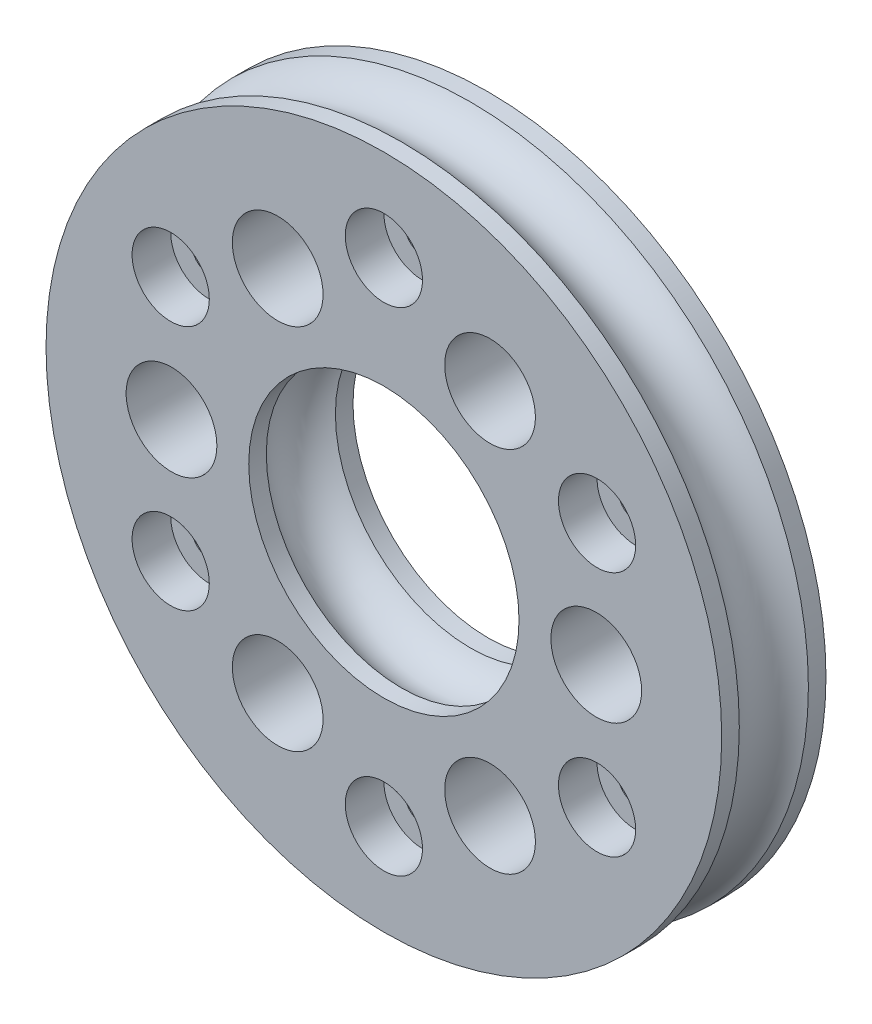
ISO-10303-21;
HEADER;
FILE_DESCRIPTION(('STEP AP214'),'2;1');
FILE_NAME('part.step','',(''),(''),'','','');
FILE_SCHEMA(('AUTOMOTIVE_DESIGN { 1 0 10303 214 1 1 1 1 }'));
ENDSEC;
DATA;
#1=APPLICATION_CONTEXT('core data for automotive mechanical design processes');
#2=APPLICATION_PROTOCOL_DEFINITION('international standard','automotive_design',2000,#1);
#3=PRODUCT_CONTEXT('',#1,'mechanical');
#4=PRODUCT('Part','Part','',(#3));
#5=PRODUCT_RELATED_PRODUCT_CATEGORY('part','',(#4));
#6=PRODUCT_DEFINITION_FORMATION('','',#4);
#7=PRODUCT_DEFINITION_CONTEXT('part definition',#1,'design');
#8=PRODUCT_DEFINITION('design','',#6,#7);
#9=PRODUCT_DEFINITION_SHAPE('','',#8);
#10=(LENGTH_UNIT() NAMED_UNIT(*) SI_UNIT(.MILLI.,.METRE.));
#11=(NAMED_UNIT(*) PLANE_ANGLE_UNIT() SI_UNIT($,.RADIAN.));
#12=(NAMED_UNIT(*) SI_UNIT($,.STERADIAN.) SOLID_ANGLE_UNIT());
#13=UNCERTAINTY_MEASURE_WITH_UNIT(LENGTH_MEASURE(1.E-05),#10,'distance_accuracy_value','');
#14=(GEOMETRIC_REPRESENTATION_CONTEXT(3) GLOBAL_UNCERTAINTY_ASSIGNED_CONTEXT((#13)) GLOBAL_UNIT_ASSIGNED_CONTEXT((#10,
#11,#12)) REPRESENTATION_CONTEXT('',''));
#15=CARTESIAN_POINT('',(0.,0.,0.));
#16=DIRECTION('',(0.,0.,1.));
#17=DIRECTION('',(1.,0.,0.));
#18=AXIS2_PLACEMENT_3D('',#15,#16,#17);
#19=CARTESIAN_POINT('',(-1.00000000000011,0.,7.3));
#20=DIRECTION('',(0.,0.,1.));
#21=DIRECTION('',(1.,0.,0.));
#22=AXIS2_PLACEMENT_3D('',#19,#20,#21);
#23=PLANE('',#22);
#24=CARTESIAN_POINT('',(10.,0.,7.3));
#25=DIRECTION('',(0.,0.,1.));
#26=DIRECTION('',(1.,0.,0.));
#27=AXIS2_PLACEMENT_3D('',#24,#25,#26);
#28=CIRCLE('',#27,2.35);
#29=CARTESIAN_POINT('',(12.35,0.,7.3));
#30=VERTEX_POINT('',#29);
#31=EDGE_CURVE('E223',#30,#30,#28,.T.);
#32=ORIENTED_EDGE('',*,*,#31,.T.);
#33=EDGE_LOOP('',(#32));
#34=FACE_BOUND('',#33,.T.);
#35=ADVANCED_FACE('F15',(#34),#23,.T.);
#36=CARTESIAN_POINT('',(-1.00000000000011,0.,7.3));
#37=DIRECTION('',(0.,0.,1.));
#38=DIRECTION('',(1.,0.,0.));
#39=AXIS2_PLACEMENT_3D('',#36,#37,#38);
#40=PLANE('',#39);
#41=CARTESIAN_POINT('',(4.5,-9.52627944162883,7.3));
#42=DIRECTION('',(0.,0.,1.));
#43=DIRECTION('',(1.,0.,0.));
#44=AXIS2_PLACEMENT_3D('',#41,#42,#43);
#45=CIRCLE('',#44,2.35);
#46=CARTESIAN_POINT('',(6.85,-9.52627944162883,7.3));
#47=VERTEX_POINT('',#46);
#48=EDGE_CURVE('E218',#47,#47,#45,.T.);
#49=ORIENTED_EDGE('',*,*,#48,.T.);
#50=EDGE_LOOP('',(#49));
#51=FACE_BOUND('',#50,.T.);
#52=ADVANCED_FACE('F361',(#51),#40,.T.);
#53=CARTESIAN_POINT('',(-1.00000000000011,0.,7.3));
#54=DIRECTION('',(0.,0.,1.));
#55=DIRECTION('',(1.,0.,0.));
#56=AXIS2_PLACEMENT_3D('',#53,#54,#55);
#57=PLANE('',#56);
#58=CARTESIAN_POINT('',(-6.5,-9.52627944162882,7.3));
#59=DIRECTION('',(0.,0.,1.));
#60=DIRECTION('',(1.,0.,0.));
#61=AXIS2_PLACEMENT_3D('',#58,#59,#60);
#62=CIRCLE('',#61,2.35);
#63=CARTESIAN_POINT('',(-4.15,-9.52627944162882,7.3));
#64=VERTEX_POINT('',#63);
#65=EDGE_CURVE('E213',#64,#64,#62,.T.);
#66=ORIENTED_EDGE('',*,*,#65,.T.);
#67=EDGE_LOOP('',(#66));
#68=FACE_BOUND('',#67,.T.);
#69=ADVANCED_FACE('F363',(#68),#57,.T.);
#70=CARTESIAN_POINT('',(-1.00000000000011,0.,7.3));
#71=DIRECTION('',(0.,0.,1.));
#72=DIRECTION('',(1.,0.,0.));
#73=AXIS2_PLACEMENT_3D('',#70,#71,#72);
#74=PLANE('',#73);
#75=CARTESIAN_POINT('',(-12.,0.,7.3));
#76=DIRECTION('',(0.,0.,1.));
#77=DIRECTION('',(1.,0.,0.));
#78=AXIS2_PLACEMENT_3D('',#75,#76,#77);
#79=CIRCLE('',#78,2.35);
#80=CARTESIAN_POINT('',(-9.65,0.,7.3));
#81=VERTEX_POINT('',#80);
#82=EDGE_CURVE('E208',#81,#81,#79,.T.);
#83=ORIENTED_EDGE('',*,*,#82,.T.);
#84=EDGE_LOOP('',(#83));
#85=FACE_BOUND('',#84,.T.);
#86=ADVANCED_FACE('F368',(#85),#74,.T.);
#87=CARTESIAN_POINT('',(-1.00000000000011,0.,7.3));
#88=DIRECTION('',(0.,0.,1.));
#89=DIRECTION('',(1.,0.,0.));
#90=AXIS2_PLACEMENT_3D('',#87,#88,#89);
#91=PLANE('',#90);
#92=CARTESIAN_POINT('',(-6.5,9.52627944162883,7.3));
#93=DIRECTION('',(0.,0.,1.));
#94=DIRECTION('',(1.,0.,0.));
#95=AXIS2_PLACEMENT_3D('',#92,#93,#94);
#96=CIRCLE('',#95,2.35);
#97=CARTESIAN_POINT('',(-4.15,9.52627944162883,7.3));
#98=VERTEX_POINT('',#97);
#99=EDGE_CURVE('E203',#98,#98,#96,.T.);
#100=ORIENTED_EDGE('',*,*,#99,.T.);
#101=EDGE_LOOP('',(#100));
#102=FACE_BOUND('',#101,.T.);
#103=ADVANCED_FACE('F243',(#102),#91,.T.);
#104=CARTESIAN_POINT('',(-1.00000000000011,0.,7.3));
#105=DIRECTION('',(0.,0.,1.));
#106=DIRECTION('',(1.,0.,0.));
#107=AXIS2_PLACEMENT_3D('',#104,#105,#106);
#108=PLANE('',#107);
#109=CARTESIAN_POINT('',(4.5,9.52627944162883,7.3));
#110=DIRECTION('',(0.,0.,1.));
#111=DIRECTION('',(1.,0.,0.));
#112=AXIS2_PLACEMENT_3D('',#109,#110,#111);
#113=CIRCLE('',#112,2.35);
#114=CARTESIAN_POINT('',(6.85,9.52627944162883,7.3));
#115=VERTEX_POINT('',#114);
#116=EDGE_CURVE('E198',#115,#115,#113,.T.);
#117=ORIENTED_EDGE('',*,*,#116,.T.);
#118=EDGE_LOOP('',(#117));
#119=FACE_BOUND('',#118,.T.);
#120=ADVANCED_FACE('F232',(#119),#108,.T.);
#121=CARTESIAN_POINT('',(10.,0.,7.3));
#122=DIRECTION('',(0.,0.,1.));
#123=DIRECTION('',(1.,0.,0.));
#124=AXIS2_PLACEMENT_3D('',#121,#122,#123);
#125=CYLINDRICAL_SURFACE('',#124,2.35);
#126=CARTESIAN_POINT('',(10.,0.,11.3));
#127=DIRECTION('',(0.,0.,1.));
#128=DIRECTION('',(1.,0.,0.));
#129=AXIS2_PLACEMENT_3D('',#126,#127,#128);
#130=CIRCLE('',#129,2.35);
#131=CARTESIAN_POINT('',(12.35,0.,11.3));
#132=VERTEX_POINT('',#131);
#133=EDGE_CURVE('E193',#132,#132,#130,.F.);
#134=ORIENTED_EDGE('',*,*,#133,.F.);
#135=EDGE_LOOP('',(#134));
#136=FACE_BOUND('',#135,.T.);
#137=ORIENTED_EDGE('',*,*,#31,.F.);
#138=EDGE_LOOP('',(#137));
#139=FACE_BOUND('',#138,.T.);
#140=ADVANCED_FACE('F229',(#136,#139),#125,.F.);
#141=CARTESIAN_POINT('',(4.5,-9.52627944162883,7.3));
#142=DIRECTION('',(0.,0.,1.));
#143=DIRECTION('',(1.,0.,0.));
#144=AXIS2_PLACEMENT_3D('',#141,#142,#143);
#145=CYLINDRICAL_SURFACE('',#144,2.35);
#146=CARTESIAN_POINT('',(4.5,-9.52627944162883,11.3));
#147=DIRECTION('',(0.,0.,1.));
#148=DIRECTION('',(1.,0.,0.));
#149=AXIS2_PLACEMENT_3D('',#146,#147,#148);
#150=CIRCLE('',#149,2.35);
#151=CARTESIAN_POINT('',(6.85,-9.52627944162883,11.3));
#152=VERTEX_POINT('',#151);
#153=EDGE_CURVE('E188',#152,#152,#150,.F.);
#154=ORIENTED_EDGE('',*,*,#153,.F.);
#155=EDGE_LOOP('',(#154));
#156=FACE_BOUND('',#155,.T.);
#157=ORIENTED_EDGE('',*,*,#48,.F.);
#158=EDGE_LOOP('',(#157));
#159=FACE_BOUND('',#158,.T.);
#160=ADVANCED_FACE('F231',(#156,#159),#145,.F.);
#161=CARTESIAN_POINT('',(-6.5,-9.52627944162882,7.3));
#162=DIRECTION('',(0.,0.,1.));
#163=DIRECTION('',(1.,0.,0.));
#164=AXIS2_PLACEMENT_3D('',#161,#162,#163);
#165=CYLINDRICAL_SURFACE('',#164,2.35);
#166=CARTESIAN_POINT('',(-6.5,-9.52627944162882,11.3));
#167=DIRECTION('',(0.,0.,1.));
#168=DIRECTION('',(1.,0.,0.));
#169=AXIS2_PLACEMENT_3D('',#166,#167,#168);
#170=CIRCLE('',#169,2.35);
#171=CARTESIAN_POINT('',(-4.15,-9.52627944162882,11.3));
#172=VERTEX_POINT('',#171);
#173=EDGE_CURVE('E183',#172,#172,#170,.F.);
#174=ORIENTED_EDGE('',*,*,#173,.F.);
#175=EDGE_LOOP('',(#174));
#176=FACE_BOUND('',#175,.T.);
#177=ORIENTED_EDGE('',*,*,#65,.F.);
#178=EDGE_LOOP('',(#177));
#179=FACE_BOUND('',#178,.T.);
#180=ADVANCED_FACE('F240',(#176,#179),#165,.F.);
#181=CARTESIAN_POINT('',(-12.,0.,7.3));
#182=DIRECTION('',(0.,0.,1.));
#183=DIRECTION('',(1.,0.,0.));
#184=AXIS2_PLACEMENT_3D('',#181,#182,#183);
#185=CYLINDRICAL_SURFACE('',#184,2.35);
#186=CARTESIAN_POINT('',(-12.,0.,11.3));
#187=DIRECTION('',(0.,0.,1.));
#188=DIRECTION('',(1.,0.,0.));
#189=AXIS2_PLACEMENT_3D('',#186,#187,#188);
#190=CIRCLE('',#189,2.35);
#191=CARTESIAN_POINT('',(-9.65,0.,11.3));
#192=VERTEX_POINT('',#191);
#193=EDGE_CURVE('E178',#192,#192,#190,.F.);
#194=ORIENTED_EDGE('',*,*,#193,.F.);
#195=EDGE_LOOP('',(#194));
#196=FACE_BOUND('',#195,.T.);
#197=ORIENTED_EDGE('',*,*,#82,.F.);
#198=EDGE_LOOP('',(#197));
#199=FACE_BOUND('',#198,.T.);
#200=ADVANCED_FACE('F383',(#196,#199),#185,.F.);
#201=CARTESIAN_POINT('',(-6.5,9.52627944162883,7.3));
#202=DIRECTION('',(0.,0.,1.));
#203=DIRECTION('',(1.,0.,0.));
#204=AXIS2_PLACEMENT_3D('',#201,#202,#203);
#205=CYLINDRICAL_SURFACE('',#204,2.35);
#206=CARTESIAN_POINT('',(-6.5,9.52627944162883,11.3));
#207=DIRECTION('',(0.,0.,1.));
#208=DIRECTION('',(1.,0.,0.));
#209=AXIS2_PLACEMENT_3D('',#206,#207,#208);
#210=CIRCLE('',#209,2.35);
#211=CARTESIAN_POINT('',(-4.15,9.52627944162883,11.3));
#212=VERTEX_POINT('',#211);
#213=EDGE_CURVE('E173',#212,#212,#210,.F.);
#214=ORIENTED_EDGE('',*,*,#213,.F.);
#215=EDGE_LOOP('',(#214));
#216=FACE_BOUND('',#215,.T.);
#217=ORIENTED_EDGE('',*,*,#99,.F.);
#218=EDGE_LOOP('',(#217));
#219=FACE_BOUND('',#218,.T.);
#220=ADVANCED_FACE('F381',(#216,#219),#205,.F.);
#221=CARTESIAN_POINT('',(4.5,9.52627944162883,7.3));
#222=DIRECTION('',(0.,0.,1.));
#223=DIRECTION('',(1.,0.,0.));
#224=AXIS2_PLACEMENT_3D('',#221,#222,#223);
#225=CYLINDRICAL_SURFACE('',#224,2.35);
#226=CARTESIAN_POINT('',(4.5,9.52627944162883,11.3));
#227=DIRECTION('',(0.,0.,1.));
#228=DIRECTION('',(1.,0.,0.));
#229=AXIS2_PLACEMENT_3D('',#226,#227,#228);
#230=CIRCLE('',#229,2.35);
#231=CARTESIAN_POINT('',(6.85,9.52627944162883,11.3));
#232=VERTEX_POINT('',#231);
#233=EDGE_CURVE('E168',#232,#232,#230,.F.);
#234=ORIENTED_EDGE('',*,*,#233,.F.);
#235=EDGE_LOOP('',(#234));
#236=FACE_BOUND('',#235,.T.);
#237=ORIENTED_EDGE('',*,*,#116,.F.);
#238=EDGE_LOOP('',(#237));
#239=FACE_BOUND('',#238,.T.);
#240=ADVANCED_FACE('F333',(#236,#239),#225,.F.);
#241=CARTESIAN_POINT('',(-1.,0.,11.3));
#242=DIRECTION('',(0.,0.,1.));
#243=DIRECTION('',(1.,0.,0.));
#244=AXIS2_PLACEMENT_3D('',#241,#242,#243);
#245=PLANE('',#244);
#246=CARTESIAN_POINT('',(-1.,0.,11.3));
#247=DIRECTION('',(0.,0.,-1.));
#248=DIRECTION('',(-1.,0.,0.));
#249=AXIS2_PLACEMENT_3D('',#246,#247,#248);
#250=CIRCLE('',#249,17.5);
#251=CARTESIAN_POINT('',(-18.5,0.,11.3));
#252=VERTEX_POINT('',#251);
#253=EDGE_CURVE('E133',#252,#252,#250,.T.);
#254=ORIENTED_EDGE('',*,*,#253,.F.);
#255=EDGE_LOOP('',(#254));
#256=FACE_BOUND('',#255,.T.);
#257=CARTESIAN_POINT('',(-1.,0.,11.3));
#258=DIRECTION('',(0.,0.,-1.));
#259=DIRECTION('',(-1.,0.,0.));
#260=AXIS2_PLACEMENT_3D('',#257,#258,#259);
#261=CIRCLE('',#260,7.);
#262=CARTESIAN_POINT('',(-8.,0.,11.3));
#263=VERTEX_POINT('',#262);
#264=EDGE_CURVE('E128',#263,#263,#261,.T.);
#265=ORIENTED_EDGE('',*,*,#264,.T.);
#266=EDGE_LOOP('',(#265));
#267=FACE_BOUND('',#266,.T.);
#268=CARTESIAN_POINT('',(-12.0418238982516,6.375,11.3));
#269=DIRECTION('',(0.,0.,1.));
#270=DIRECTION('',(1.,0.,0.));
#271=AXIS2_PLACEMENT_3D('',#268,#269,#270);
#272=CIRCLE('',#271,2.);
#273=CARTESIAN_POINT('',(-10.0418238982516,6.375,11.3));
#274=VERTEX_POINT('',#273);
#275=EDGE_CURVE('E138',#274,#274,#272,.F.);
#276=ORIENTED_EDGE('',*,*,#275,.T.);
#277=EDGE_LOOP('',(#276));
#278=FACE_BOUND('',#277,.T.);
#279=CARTESIAN_POINT('',(-12.0418238982516,-6.375,11.3));
#280=DIRECTION('',(0.,0.,1.));
#281=DIRECTION('',(1.,0.,0.));
#282=AXIS2_PLACEMENT_3D('',#279,#280,#281);
#283=CIRCLE('',#282,2.);
#284=CARTESIAN_POINT('',(-10.0418238982516,-6.375,11.3));
#285=VERTEX_POINT('',#284);
#286=EDGE_CURVE('E143',#285,#285,#283,.F.);
#287=ORIENTED_EDGE('',*,*,#286,.T.);
#288=EDGE_LOOP('',(#287));
#289=FACE_BOUND('',#288,.T.);
#290=CARTESIAN_POINT('',(-1.,-12.75,11.3));
#291=DIRECTION('',(0.,0.,1.));
#292=DIRECTION('',(1.,0.,0.));
#293=AXIS2_PLACEMENT_3D('',#290,#291,#292);
#294=CIRCLE('',#293,2.);
#295=CARTESIAN_POINT('',(1.,-12.75,11.3));
#296=VERTEX_POINT('',#295);
#297=EDGE_CURVE('E148',#296,#296,#294,.F.);
#298=ORIENTED_EDGE('',*,*,#297,.T.);
#299=EDGE_LOOP('',(#298));
#300=FACE_BOUND('',#299,.T.);
#301=CARTESIAN_POINT('',(10.0418238982516,-6.375,11.3));
#302=DIRECTION('',(0.,0.,1.));
#303=DIRECTION('',(1.,0.,0.));
#304=AXIS2_PLACEMENT_3D('',#301,#302,#303);
#305=CIRCLE('',#304,2.);
#306=CARTESIAN_POINT('',(12.0418238982516,-6.375,11.3));
#307=VERTEX_POINT('',#306);
#308=EDGE_CURVE('E153',#307,#307,#305,.F.);
#309=ORIENTED_EDGE('',*,*,#308,.T.);
#310=EDGE_LOOP('',(#309));
#311=FACE_BOUND('',#310,.T.);
#312=CARTESIAN_POINT('',(10.0418238982516,6.375,11.3));
#313=DIRECTION('',(0.,0.,1.));
#314=DIRECTION('',(1.,0.,0.));
#315=AXIS2_PLACEMENT_3D('',#312,#313,#314);
#316=CIRCLE('',#315,2.);
#317=CARTESIAN_POINT('',(12.0418238982516,6.375,11.3));
#318=VERTEX_POINT('',#317);
#319=EDGE_CURVE('E158',#318,#318,#316,.F.);
#320=ORIENTED_EDGE('',*,*,#319,.T.);
#321=EDGE_LOOP('',(#320));
#322=FACE_BOUND('',#321,.T.);
#323=CARTESIAN_POINT('',(-1.,12.75,11.3));
#324=DIRECTION('',(0.,0.,1.));
#325=DIRECTION('',(1.,0.,0.));
#326=AXIS2_PLACEMENT_3D('',#323,#324,#325);
#327=CIRCLE('',#326,2.);
#328=CARTESIAN_POINT('',(1.,12.75,11.3));
#329=VERTEX_POINT('',#328);
#330=EDGE_CURVE('E163',#329,#329,#327,.F.);
#331=ORIENTED_EDGE('',*,*,#330,.T.);
#332=EDGE_LOOP('',(#331));
#333=FACE_BOUND('',#332,.T.);
#334=ORIENTED_EDGE('',*,*,#233,.T.);
#335=EDGE_LOOP('',(#334));
#336=FACE_BOUND('',#335,.T.);
#337=ORIENTED_EDGE('',*,*,#213,.T.);
#338=EDGE_LOOP('',(#337));
#339=FACE_BOUND('',#338,.T.);
#340=ORIENTED_EDGE('',*,*,#193,.T.);
#341=EDGE_LOOP('',(#340));
#342=FACE_BOUND('',#341,.T.);
#343=ORIENTED_EDGE('',*,*,#173,.T.);
#344=EDGE_LOOP('',(#343));
#345=FACE_BOUND('',#344,.T.);
#346=ORIENTED_EDGE('',*,*,#153,.T.);
#347=EDGE_LOOP('',(#346));
#348=FACE_BOUND('',#347,.T.);
#349=ORIENTED_EDGE('',*,*,#133,.T.);
#350=EDGE_LOOP('',(#349));
#351=FACE_BOUND('',#350,.T.);
#352=ADVANCED_FACE('F329',(#256,#267,#278,#289,#300,#311,#322,#333,#336,#339,#342,#345,#348,
#351),#245,.T.);
#353=CARTESIAN_POINT('',(-1.,12.75,9.3));
#354=DIRECTION('',(0.,0.,1.));
#355=DIRECTION('',(1.,0.,0.));
#356=AXIS2_PLACEMENT_3D('',#353,#354,#355);
#357=CYLINDRICAL_SURFACE('',#356,2.);
#358=ORIENTED_EDGE('',*,*,#330,.F.);
#359=EDGE_LOOP('',(#358));
#360=FACE_BOUND('',#359,.T.);
#361=CARTESIAN_POINT('',(-1.,12.75,9.3));
#362=DIRECTION('',(0.,0.,1.));
#363=DIRECTION('',(1.,0.,0.));
#364=AXIS2_PLACEMENT_3D('',#361,#362,#363);
#365=CIRCLE('',#364,2.);
#366=CARTESIAN_POINT('',(1.,12.75,9.3));
#367=VERTEX_POINT('',#366);
#368=EDGE_CURVE('E123',#367,#367,#365,.T.);
#369=ORIENTED_EDGE('',*,*,#368,.F.);
#370=EDGE_LOOP('',(#369));
#371=FACE_BOUND('',#370,.T.);
#372=ADVANCED_FACE('F332',(#360,#371),#357,.F.);
#373=CARTESIAN_POINT('',(10.0418238982516,6.375,9.3));
#374=DIRECTION('',(0.,0.,1.));
#375=DIRECTION('',(1.,0.,0.));
#376=AXIS2_PLACEMENT_3D('',#373,#374,#375);
#377=CYLINDRICAL_SURFACE('',#376,2.);
#378=ORIENTED_EDGE('',*,*,#319,.F.);
#379=EDGE_LOOP('',(#378));
#380=FACE_BOUND('',#379,.T.);
#381=CARTESIAN_POINT('',(10.0418238982516,6.375,9.3));
#382=DIRECTION('',(0.,0.,1.));
#383=DIRECTION('',(1.,0.,0.));
#384=AXIS2_PLACEMENT_3D('',#381,#382,#383);
#385=CIRCLE('',#384,2.);
#386=CARTESIAN_POINT('',(12.0418238982516,6.375,9.3));
#387=VERTEX_POINT('',#386);
#388=EDGE_CURVE('E118',#387,#387,#385,.T.);
#389=ORIENTED_EDGE('',*,*,#388,.F.);
#390=EDGE_LOOP('',(#389));
#391=FACE_BOUND('',#390,.T.);
#392=ADVANCED_FACE('F437',(#380,#391),#377,.F.);
#393=CARTESIAN_POINT('',(10.0418238982516,-6.375,9.3));
#394=DIRECTION('',(0.,0.,1.));
#395=DIRECTION('',(1.,0.,0.));
#396=AXIS2_PLACEMENT_3D('',#393,#394,#395);
#397=CYLINDRICAL_SURFACE('',#396,2.);
#398=ORIENTED_EDGE('',*,*,#308,.F.);
#399=EDGE_LOOP('',(#398));
#400=FACE_BOUND('',#399,.T.);
#401=CARTESIAN_POINT('',(10.0418238982516,-6.375,9.3));
#402=DIRECTION('',(0.,0.,1.));
#403=DIRECTION('',(1.,0.,0.));
#404=AXIS2_PLACEMENT_3D('',#401,#402,#403);
#405=CIRCLE('',#404,2.);
#406=CARTESIAN_POINT('',(12.0418238982516,-6.375,9.3));
#407=VERTEX_POINT('',#406);
#408=EDGE_CURVE('E113',#407,#407,#405,.T.);
#409=ORIENTED_EDGE('',*,*,#408,.F.);
#410=EDGE_LOOP('',(#409));
#411=FACE_BOUND('',#410,.T.);
#412=ADVANCED_FACE('F447',(#400,#411),#397,.F.);
#413=CARTESIAN_POINT('',(-1.,-12.75,9.3));
#414=DIRECTION('',(0.,0.,1.));
#415=DIRECTION('',(1.,0.,0.));
#416=AXIS2_PLACEMENT_3D('',#413,#414,#415);
#417=CYLINDRICAL_SURFACE('',#416,2.);
#418=ORIENTED_EDGE('',*,*,#297,.F.);
#419=EDGE_LOOP('',(#418));
#420=FACE_BOUND('',#419,.T.);
#421=CARTESIAN_POINT('',(-1.,-12.75,9.3));
#422=DIRECTION('',(0.,0.,1.));
#423=DIRECTION('',(1.,0.,0.));
#424=AXIS2_PLACEMENT_3D('',#421,#422,#423);
#425=CIRCLE('',#424,2.);
#426=CARTESIAN_POINT('',(1.,-12.75,9.3));
#427=VERTEX_POINT('',#426);
#428=EDGE_CURVE('E108',#427,#427,#425,.T.);
#429=ORIENTED_EDGE('',*,*,#428,.F.);
#430=EDGE_LOOP('',(#429));
#431=FACE_BOUND('',#430,.T.);
#432=ADVANCED_FACE('F457',(#420,#431),#417,.F.);
#433=CARTESIAN_POINT('',(-12.0418238982516,-6.375,9.3));
#434=DIRECTION('',(0.,0.,1.));
#435=DIRECTION('',(1.,0.,0.));
#436=AXIS2_PLACEMENT_3D('',#433,#434,#435);
#437=CYLINDRICAL_SURFACE('',#436,2.);
#438=ORIENTED_EDGE('',*,*,#286,.F.);
#439=EDGE_LOOP('',(#438));
#440=FACE_BOUND('',#439,.T.);
#441=CARTESIAN_POINT('',(-12.0418238982516,-6.375,9.3));
#442=DIRECTION('',(0.,0.,1.));
#443=DIRECTION('',(1.,0.,0.));
#444=AXIS2_PLACEMENT_3D('',#441,#442,#443);
#445=CIRCLE('',#444,2.);
#446=CARTESIAN_POINT('',(-10.0418238982516,-6.375,9.3));
#447=VERTEX_POINT('',#446);
#448=EDGE_CURVE('E103',#447,#447,#445,.T.);
#449=ORIENTED_EDGE('',*,*,#448,.F.);
#450=EDGE_LOOP('',(#449));
#451=FACE_BOUND('',#450,.T.);
#452=ADVANCED_FACE('F467',(#440,#451),#437,.F.);
#453=CARTESIAN_POINT('',(-12.0418238982516,6.375,9.3));
#454=DIRECTION('',(0.,0.,1.));
#455=DIRECTION('',(1.,0.,0.));
#456=AXIS2_PLACEMENT_3D('',#453,#454,#455);
#457=CYLINDRICAL_SURFACE('',#456,2.);
#458=ORIENTED_EDGE('',*,*,#275,.F.);
#459=EDGE_LOOP('',(#458));
#460=FACE_BOUND('',#459,.T.);
#461=CARTESIAN_POINT('',(-12.0418238982516,6.375,9.3));
#462=DIRECTION('',(0.,0.,1.));
#463=DIRECTION('',(1.,0.,0.));
#464=AXIS2_PLACEMENT_3D('',#461,#462,#463);
#465=CIRCLE('',#464,2.);
#466=CARTESIAN_POINT('',(-10.0418238982516,6.375,9.3));
#467=VERTEX_POINT('',#466);
#468=EDGE_CURVE('E99',#467,#467,#465,.T.);
#469=ORIENTED_EDGE('',*,*,#468,.F.);
#470=EDGE_LOOP('',(#469));
#471=FACE_BOUND('',#470,.T.);
#472=ADVANCED_FACE('F477',(#460,#471),#457,.F.);
#473=CARTESIAN_POINT('',(-1.,0.,5.4));
#474=DIRECTION('',(0.,0.,-1.));
#475=DIRECTION('',(-1.,0.,0.));
#476=AXIS2_PLACEMENT_3D('',#473,#474,#475);
#477=CYLINDRICAL_SURFACE('',#476,17.5);
#478=ORIENTED_EDGE('',*,*,#253,.T.);
#479=EDGE_LOOP('',(#478));
#480=FACE_BOUND('',#479,.T.);
#481=CARTESIAN_POINT('',(-1.,0.,10.3895530168173));
#482=DIRECTION('',(0.,0.,-1.));
#483=DIRECTION('',(-1.,0.,0.));
#484=AXIS2_PLACEMENT_3D('',#481,#482,#483);
#485=CIRCLE('',#484,17.5);
#486=CARTESIAN_POINT('',(-18.5,0.,10.3895530168173));
#487=VERTEX_POINT('',#486);
#488=EDGE_CURVE('E102',#487,#487,#485,.F.);
#489=ORIENTED_EDGE('',*,*,#488,.T.);
#490=EDGE_LOOP('',(#489));
#491=FACE_BOUND('',#490,.T.);
#492=ADVANCED_FACE('F306',(#480,#491),#477,.T.);
#493=CARTESIAN_POINT('',(-1.,0.,5.4));
#494=DIRECTION('',(0.,0.,-1.));
#495=DIRECTION('',(-1.,0.,0.));
#496=AXIS2_PLACEMENT_3D('',#493,#494,#495);
#497=CYLINDRICAL_SURFACE('',#496,7.);
#498=CARTESIAN_POINT('',(-1.,0.,10.3895530168173));
#499=DIRECTION('',(0.,0.,-1.));
#500=DIRECTION('',(-1.,0.,0.));
#501=AXIS2_PLACEMENT_3D('',#498,#499,#500);
#502=CIRCLE('',#501,7.00000000000001);
#503=CARTESIAN_POINT('',(-8.00000000000001,0.,10.3895530168173));
#504=VERTEX_POINT('',#503);
#505=EDGE_CURVE('E96',#504,#504,#502,.T.);
#506=ORIENTED_EDGE('',*,*,#505,.T.);
#507=EDGE_LOOP('',(#506));
#508=FACE_BOUND('',#507,.T.);
#509=ORIENTED_EDGE('',*,*,#264,.F.);
#510=EDGE_LOOP('',(#509));
#511=FACE_BOUND('',#510,.T.);
#512=ADVANCED_FACE('F322',(#508,#511),#497,.F.);
#513=CARTESIAN_POINT('',(-1.,0.,9.3));
#514=DIRECTION('',(0.,0.,1.));
#515=DIRECTION('',(1.,0.,0.));
#516=AXIS2_PLACEMENT_3D('',#513,#514,#515);
#517=PLANE('',#516);
#518=CARTESIAN_POINT('',(-1.,12.75,9.3));
#519=DIRECTION('',(0.,0.,1.));
#520=DIRECTION('',(1.,0.,0.));
#521=AXIS2_PLACEMENT_3D('',#518,#519,#520);
#522=CIRCLE('',#521,0.9);
#523=CARTESIAN_POINT('',(-0.1,12.75,9.3));
#524=VERTEX_POINT('',#523);
#525=EDGE_CURVE('E91',#524,#524,#522,.F.);
#526=ORIENTED_EDGE('',*,*,#525,.T.);
#527=EDGE_LOOP('',(#526));
#528=FACE_BOUND('',#527,.T.);
#529=ORIENTED_EDGE('',*,*,#368,.T.);
#530=EDGE_LOOP('',(#529));
#531=FACE_BOUND('',#530,.T.);
#532=ADVANCED_FACE('F325',(#528,#531),#517,.T.);
#533=CARTESIAN_POINT('',(-1.,0.,9.3));
#534=DIRECTION('',(0.,0.,1.));
#535=DIRECTION('',(1.,0.,0.));
#536=AXIS2_PLACEMENT_3D('',#533,#534,#535);
#537=PLANE('',#536);
#538=CARTESIAN_POINT('',(10.0418238982516,6.375,9.3));
#539=DIRECTION('',(0.,0.,1.));
#540=DIRECTION('',(1.,0.,0.));
#541=AXIS2_PLACEMENT_3D('',#538,#539,#540);
#542=CIRCLE('',#541,0.9);
#543=CARTESIAN_POINT('',(10.9418238982516,6.375,9.3));
#544=VERTEX_POINT('',#543);
#545=EDGE_CURVE('E86',#544,#544,#542,.F.);
#546=ORIENTED_EDGE('',*,*,#545,.T.);
#547=EDGE_LOOP('',(#546));
#548=FACE_BOUND('',#547,.T.);
#549=ORIENTED_EDGE('',*,*,#388,.T.);
#550=EDGE_LOOP('',(#549));
#551=FACE_BOUND('',#550,.T.);
#552=ADVANCED_FACE('F511',(#548,#551),#537,.T.);
#553=CARTESIAN_POINT('',(-1.,0.,9.3));
#554=DIRECTION('',(0.,0.,1.));
#555=DIRECTION('',(1.,0.,0.));
#556=AXIS2_PLACEMENT_3D('',#553,#554,#555);
#557=PLANE('',#556);
#558=CARTESIAN_POINT('',(10.0418238982516,-6.375,9.3));
#559=DIRECTION('',(0.,0.,1.));
#560=DIRECTION('',(1.,0.,0.));
#561=AXIS2_PLACEMENT_3D('',#558,#559,#560);
#562=CIRCLE('',#561,0.9);
#563=CARTESIAN_POINT('',(10.9418238982516,-6.375,9.3));
#564=VERTEX_POINT('',#563);
#565=EDGE_CURVE('E81',#564,#564,#562,.F.);
#566=ORIENTED_EDGE('',*,*,#565,.T.);
#567=EDGE_LOOP('',(#566));
#568=FACE_BOUND('',#567,.T.);
#569=ORIENTED_EDGE('',*,*,#408,.T.);
#570=EDGE_LOOP('',(#569));
#571=FACE_BOUND('',#570,.T.);
#572=ADVANCED_FACE('F521',(#568,#571),#557,.T.);
#573=CARTESIAN_POINT('',(-1.,0.,9.3));
#574=DIRECTION('',(0.,0.,1.));
#575=DIRECTION('',(1.,0.,0.));
#576=AXIS2_PLACEMENT_3D('',#573,#574,#575);
#577=PLANE('',#576);
#578=CARTESIAN_POINT('',(-1.,-12.75,9.3));
#579=DIRECTION('',(0.,0.,1.));
#580=DIRECTION('',(1.,0.,0.));
#581=AXIS2_PLACEMENT_3D('',#578,#579,#580);
#582=CIRCLE('',#581,0.9);
#583=CARTESIAN_POINT('',(-0.1,-12.75,9.3));
#584=VERTEX_POINT('',#583);
#585=EDGE_CURVE('E76',#584,#584,#582,.F.);
#586=ORIENTED_EDGE('',*,*,#585,.T.);
#587=EDGE_LOOP('',(#586));
#588=FACE_BOUND('',#587,.T.);
#589=ORIENTED_EDGE('',*,*,#428,.T.);
#590=EDGE_LOOP('',(#589));
#591=FACE_BOUND('',#590,.T.);
#592=ADVANCED_FACE('F531',(#588,#591),#577,.T.);
#593=CARTESIAN_POINT('',(-1.,0.,9.3));
#594=DIRECTION('',(0.,0.,1.));
#595=DIRECTION('',(1.,0.,0.));
#596=AXIS2_PLACEMENT_3D('',#593,#594,#595);
#597=PLANE('',#596);
#598=CARTESIAN_POINT('',(-12.0418238982516,-6.375,9.3));
#599=DIRECTION('',(0.,0.,1.));
#600=DIRECTION('',(1.,0.,0.));
#601=AXIS2_PLACEMENT_3D('',#598,#599,#600);
#602=CIRCLE('',#601,0.9);
#603=CARTESIAN_POINT('',(-11.1418238982516,-6.375,9.3));
#604=VERTEX_POINT('',#603);
#605=EDGE_CURVE('E71',#604,#604,#602,.F.);
#606=ORIENTED_EDGE('',*,*,#605,.T.);
#607=EDGE_LOOP('',(#606));
#608=FACE_BOUND('',#607,.T.);
#609=ORIENTED_EDGE('',*,*,#448,.T.);
#610=EDGE_LOOP('',(#609));
#611=FACE_BOUND('',#610,.T.);
#612=ADVANCED_FACE('F541',(#608,#611),#597,.T.);
#613=CARTESIAN_POINT('',(-1.,0.,9.3));
#614=DIRECTION('',(0.,0.,1.));
#615=DIRECTION('',(1.,0.,0.));
#616=AXIS2_PLACEMENT_3D('',#613,#614,#615);
#617=PLANE('',#616);
#618=CARTESIAN_POINT('',(-12.0418238982516,6.375,9.3));
#619=DIRECTION('',(0.,0.,1.));
#620=DIRECTION('',(1.,0.,0.));
#621=AXIS2_PLACEMENT_3D('',#618,#619,#620);
#622=CIRCLE('',#621,0.9);
#623=CARTESIAN_POINT('',(-11.1418238982516,6.375,9.3));
#624=VERTEX_POINT('',#623);
#625=EDGE_CURVE('E67',#624,#624,#622,.F.);
#626=ORIENTED_EDGE('',*,*,#625,.T.);
#627=EDGE_LOOP('',(#626));
#628=FACE_BOUND('',#627,.T.);
#629=ORIENTED_EDGE('',*,*,#468,.T.);
#630=EDGE_LOOP('',(#629));
#631=FACE_BOUND('',#630,.T.);
#632=ADVANCED_FACE('F310',(#628,#631),#617,.T.);
#633=CARTESIAN_POINT('',(-1.,0.,8.6));
#634=DIRECTION('',(0.,0.,-1.));
#635=DIRECTION('',(-1.,0.,0.));
#636=AXIS2_PLACEMENT_3D('',#633,#634,#635);
#637=TOROIDAL_SURFACE('',#636,18.5,2.05);
#638=ORIENTED_EDGE('',*,*,#488,.F.);
#639=EDGE_LOOP('',(#638));
#640=FACE_BOUND('',#639,.T.);
#641=CARTESIAN_POINT('',(-1.,0.,6.81044698318267));
#642=DIRECTION('',(0.,0.,-1.));
#643=DIRECTION('',(-1.,0.,0.));
#644=AXIS2_PLACEMENT_3D('',#641,#642,#643);
#645=CIRCLE('',#644,17.5);
#646=CARTESIAN_POINT('',(-18.5,0.,6.81044698318267));
#647=VERTEX_POINT('',#646);
#648=EDGE_CURVE('E70',#647,#647,#645,.T.);
#649=ORIENTED_EDGE('',*,*,#648,.F.);
#650=EDGE_LOOP('',(#649));
#651=FACE_BOUND('',#650,.T.);
#652=ADVANCED_FACE('F290',(#640,#651),#637,.F.);
#653=CARTESIAN_POINT('',(-1.,0.,8.6));
#654=DIRECTION('',(0.,0.,-1.));
#655=DIRECTION('',(-1.,0.,0.));
#656=AXIS2_PLACEMENT_3D('',#653,#654,#655);
#657=TOROIDAL_SURFACE('',#656,6.,2.05);
#658=CARTESIAN_POINT('',(-1.,0.,6.81044698318267));
#659=DIRECTION('',(0.,0.,-1.));
#660=DIRECTION('',(-1.,0.,0.));
#661=AXIS2_PLACEMENT_3D('',#658,#659,#660);
#662=CIRCLE('',#661,7.);
#663=CARTESIAN_POINT('',(-8.,0.,6.81044698318267));
#664=VERTEX_POINT('',#663);
#665=EDGE_CURVE('E64',#664,#664,#662,.T.);
#666=ORIENTED_EDGE('',*,*,#665,.T.);
#667=EDGE_LOOP('',(#666));
#668=FACE_BOUND('',#667,.T.);
#669=ORIENTED_EDGE('',*,*,#505,.F.);
#670=EDGE_LOOP('',(#669));
#671=FACE_BOUND('',#670,.T.);
#672=ADVANCED_FACE('F285',(#668,#671),#657,.F.);
#673=CARTESIAN_POINT('',(-1.,12.75,-53.4343385443223));
#674=DIRECTION('',(0.,0.,1.));
#675=DIRECTION('',(1.,0.,0.));
#676=AXIS2_PLACEMENT_3D('',#673,#674,#675);
#677=CYLINDRICAL_SURFACE('',#676,0.9);
#678=ORIENTED_EDGE('',*,*,#525,.F.);
#679=EDGE_LOOP('',(#678));
#680=FACE_BOUND('',#679,.T.);
#681=CARTESIAN_POINT('',(-1.,12.75,5.9));
#682=DIRECTION('',(0.,0.,1.));
#683=DIRECTION('',(1.,0.,0.));
#684=AXIS2_PLACEMENT_3D('',#681,#682,#683);
#685=CIRCLE('',#684,0.9);
#686=CARTESIAN_POINT('',(-0.1,12.75,5.9));
#687=VERTEX_POINT('',#686);
#688=EDGE_CURVE('E59',#687,#687,#685,.F.);
#689=ORIENTED_EDGE('',*,*,#688,.T.);
#690=EDGE_LOOP('',(#689));
#691=FACE_BOUND('',#690,.T.);
#692=ADVANCED_FACE('F281',(#680,#691),#677,.F.);
#693=CARTESIAN_POINT('',(10.0418238982516,6.375,-53.4343385443223));
#694=DIRECTION('',(0.,0.,1.));
#695=DIRECTION('',(1.,0.,0.));
#696=AXIS2_PLACEMENT_3D('',#693,#694,#695);
#697=CYLINDRICAL_SURFACE('',#696,0.9);
#698=ORIENTED_EDGE('',*,*,#545,.F.);
#699=EDGE_LOOP('',(#698));
#700=FACE_BOUND('',#699,.T.);
#701=CARTESIAN_POINT('',(10.0418238982516,6.375,5.9));
#702=DIRECTION('',(0.,0.,1.));
#703=DIRECTION('',(1.,0.,0.));
#704=AXIS2_PLACEMENT_3D('',#701,#702,#703);
#705=CIRCLE('',#704,0.9);
#706=CARTESIAN_POINT('',(10.9418238982516,6.375,5.9));
#707=VERTEX_POINT('',#706);
#708=EDGE_CURVE('E54',#707,#707,#705,.F.);
#709=ORIENTED_EDGE('',*,*,#708,.T.);
#710=EDGE_LOOP('',(#709));
#711=FACE_BOUND('',#710,.T.);
#712=ADVANCED_FACE('F277',(#700,#711),#697,.F.);
#713=CARTESIAN_POINT('',(10.0418238982516,-6.375,-53.4343385443223));
#714=DIRECTION('',(0.,0.,1.));
#715=DIRECTION('',(1.,0.,0.));
#716=AXIS2_PLACEMENT_3D('',#713,#714,#715);
#717=CYLINDRICAL_SURFACE('',#716,0.9);
#718=ORIENTED_EDGE('',*,*,#565,.F.);
#719=EDGE_LOOP('',(#718));
#720=FACE_BOUND('',#719,.T.);
#721=CARTESIAN_POINT('',(10.0418238982516,-6.375,5.9));
#722=DIRECTION('',(0.,0.,1.));
#723=DIRECTION('',(1.,0.,0.));
#724=AXIS2_PLACEMENT_3D('',#721,#722,#723);
#725=CIRCLE('',#724,0.9);
#726=CARTESIAN_POINT('',(10.9418238982516,-6.375,5.9));
#727=VERTEX_POINT('',#726);
#728=EDGE_CURVE('E49',#727,#727,#725,.F.);
#729=ORIENTED_EDGE('',*,*,#728,.T.);
#730=EDGE_LOOP('',(#729));
#731=FACE_BOUND('',#730,.T.);
#732=ADVANCED_FACE('F273',(#720,#731),#717,.F.);
#733=CARTESIAN_POINT('',(-1.,-12.75,-53.4343385443223));
#734=DIRECTION('',(0.,0.,1.));
#735=DIRECTION('',(1.,0.,0.));
#736=AXIS2_PLACEMENT_3D('',#733,#734,#735);
#737=CYLINDRICAL_SURFACE('',#736,0.9);
#738=ORIENTED_EDGE('',*,*,#585,.F.);
#739=EDGE_LOOP('',(#738));
#740=FACE_BOUND('',#739,.T.);
#741=CARTESIAN_POINT('',(-1.,-12.75,5.9));
#742=DIRECTION('',(0.,0.,1.));
#743=DIRECTION('',(1.,0.,0.));
#744=AXIS2_PLACEMENT_3D('',#741,#742,#743);
#745=CIRCLE('',#744,0.9);
#746=CARTESIAN_POINT('',(-0.1,-12.75,5.9));
#747=VERTEX_POINT('',#746);
#748=EDGE_CURVE('E44',#747,#747,#745,.F.);
#749=ORIENTED_EDGE('',*,*,#748,.T.);
#750=EDGE_LOOP('',(#749));
#751=FACE_BOUND('',#750,.T.);
#752=ADVANCED_FACE('F269',(#740,#751),#737,.F.);
#753=CARTESIAN_POINT('',(-12.0418238982516,-6.375,-53.4343385443223));
#754=DIRECTION('',(0.,0.,1.));
#755=DIRECTION('',(1.,0.,0.));
#756=AXIS2_PLACEMENT_3D('',#753,#754,#755);
#757=CYLINDRICAL_SURFACE('',#756,0.9);
#758=ORIENTED_EDGE('',*,*,#605,.F.);
#759=EDGE_LOOP('',(#758));
#760=FACE_BOUND('',#759,.T.);
#761=CARTESIAN_POINT('',(-12.0418238982516,-6.375,5.9));
#762=DIRECTION('',(0.,0.,1.));
#763=DIRECTION('',(1.,0.,0.));
#764=AXIS2_PLACEMENT_3D('',#761,#762,#763);
#765=CIRCLE('',#764,0.9);
#766=CARTESIAN_POINT('',(-11.1418238982516,-6.375,5.9));
#767=VERTEX_POINT('',#766);
#768=EDGE_CURVE('E39',#767,#767,#765,.F.);
#769=ORIENTED_EDGE('',*,*,#768,.T.);
#770=EDGE_LOOP('',(#769));
#771=FACE_BOUND('',#770,.T.);
#772=ADVANCED_FACE('F265',(#760,#771),#757,.F.);
#773=CARTESIAN_POINT('',(-12.0418238982516,6.375,-53.4343385443223));
#774=DIRECTION('',(0.,0.,1.));
#775=DIRECTION('',(1.,0.,0.));
#776=AXIS2_PLACEMENT_3D('',#773,#774,#775);
#777=CYLINDRICAL_SURFACE('',#776,0.9);
#778=ORIENTED_EDGE('',*,*,#625,.F.);
#779=EDGE_LOOP('',(#778));
#780=FACE_BOUND('',#779,.T.);
#781=CARTESIAN_POINT('',(-12.0418238982516,6.375,5.9));
#782=DIRECTION('',(0.,0.,1.));
#783=DIRECTION('',(1.,0.,0.));
#784=AXIS2_PLACEMENT_3D('',#781,#782,#783);
#785=CIRCLE('',#784,0.9);
#786=CARTESIAN_POINT('',(-11.1418238982516,6.375,5.9));
#787=VERTEX_POINT('',#786);
#788=EDGE_CURVE('E27',#787,#787,#785,.F.);
#789=ORIENTED_EDGE('',*,*,#788,.T.);
#790=EDGE_LOOP('',(#789));
#791=FACE_BOUND('',#790,.T.);
#792=ADVANCED_FACE('F261',(#780,#791),#777,.F.);
#793=CARTESIAN_POINT('',(-1.,0.,5.4));
#794=DIRECTION('',(0.,0.,-1.));
#795=DIRECTION('',(-1.,0.,0.));
#796=AXIS2_PLACEMENT_3D('',#793,#794,#795);
#797=CYLINDRICAL_SURFACE('',#796,17.5);
#798=ORIENTED_EDGE('',*,*,#648,.T.);
#799=EDGE_LOOP('',(#798));
#800=FACE_BOUND('',#799,.T.);
#801=CARTESIAN_POINT('',(-1.,0.,5.9));
#802=DIRECTION('',(0.,0.,-1.));
#803=DIRECTION('',(-1.,0.,0.));
#804=AXIS2_PLACEMENT_3D('',#801,#802,#803);
#805=CIRCLE('',#804,17.5);
#806=CARTESIAN_POINT('',(-18.5,0.,5.9));
#807=VERTEX_POINT('',#806);
#808=EDGE_CURVE('E22',#807,#807,#805,.F.);
#809=ORIENTED_EDGE('',*,*,#808,.T.);
#810=EDGE_LOOP('',(#809));
#811=FACE_BOUND('',#810,.T.);
#812=ADVANCED_FACE('F255',(#800,#811),#797,.T.);
#813=CARTESIAN_POINT('',(-1.,0.,5.4));
#814=DIRECTION('',(0.,0.,-1.));
#815=DIRECTION('',(-1.,0.,0.));
#816=AXIS2_PLACEMENT_3D('',#813,#814,#815);
#817=CYLINDRICAL_SURFACE('',#816,7.);
#818=CARTESIAN_POINT('',(-1.,0.,5.9));
#819=DIRECTION('',(0.,0.,-1.));
#820=DIRECTION('',(-1.,0.,0.));
#821=AXIS2_PLACEMENT_3D('',#818,#819,#820);
#822=CIRCLE('',#821,7.);
#823=CARTESIAN_POINT('',(-8.,0.,5.9));
#824=VERTEX_POINT('',#823);
#825=EDGE_CURVE('E10',#824,#824,#822,.T.);
#826=ORIENTED_EDGE('',*,*,#825,.T.);
#827=EDGE_LOOP('',(#826));
#828=FACE_BOUND('',#827,.T.);
#829=ORIENTED_EDGE('',*,*,#665,.F.);
#830=EDGE_LOOP('',(#829));
#831=FACE_BOUND('',#830,.T.);
#832=ADVANCED_FACE('F249',(#828,#831),#817,.F.);
#833=CARTESIAN_POINT('',(-1.,0.,5.9));
#834=DIRECTION('',(0.,0.,1.));
#835=DIRECTION('',(1.,0.,0.));
#836=AXIS2_PLACEMENT_3D('',#833,#834,#835);
#837=PLANE('',#836);
#838=ORIENTED_EDGE('',*,*,#825,.F.);
#839=EDGE_LOOP('',(#838));
#840=FACE_BOUND('',#839,.T.);
#841=ORIENTED_EDGE('',*,*,#808,.F.);
#842=EDGE_LOOP('',(#841));
#843=FACE_BOUND('',#842,.T.);
#844=ORIENTED_EDGE('',*,*,#788,.F.);
#845=EDGE_LOOP('',(#844));
#846=FACE_BOUND('',#845,.T.);
#847=ORIENTED_EDGE('',*,*,#768,.F.);
#848=EDGE_LOOP('',(#847));
#849=FACE_BOUND('',#848,.T.);
#850=ORIENTED_EDGE('',*,*,#748,.F.);
#851=EDGE_LOOP('',(#850));
#852=FACE_BOUND('',#851,.T.);
#853=ORIENTED_EDGE('',*,*,#728,.F.);
#854=EDGE_LOOP('',(#853));
#855=FACE_BOUND('',#854,.T.);
#856=ORIENTED_EDGE('',*,*,#708,.F.);
#857=EDGE_LOOP('',(#856));
#858=FACE_BOUND('',#857,.T.);
#859=ORIENTED_EDGE('',*,*,#688,.F.);
#860=EDGE_LOOP('',(#859));
#861=FACE_BOUND('',#860,.T.);
#862=ADVANCED_FACE('F247',(#840,#843,#846,#849,#852,#855,#858,#861),#837,.F.);
#863=CLOSED_SHELL('',(#35,#52,#69,#86,#103,#120,#140,#160,#180,#200,#220,#240,#352,#372,#392,
#412,#432,#452,#472,#492,#512,#532,#552,#572,#592,#612,#632,#652,#672,#692,#712,#732,#752,#772,
#792,#812,#832,#862));
#864=MANIFOLD_SOLID_BREP('B1',#863);
#865=ADVANCED_BREP_SHAPE_REPRESENTATION('',(#18,#864),#14);
#866=SHAPE_DEFINITION_REPRESENTATION(#9,#865);
ENDSEC;
END-ISO-10303-21;
